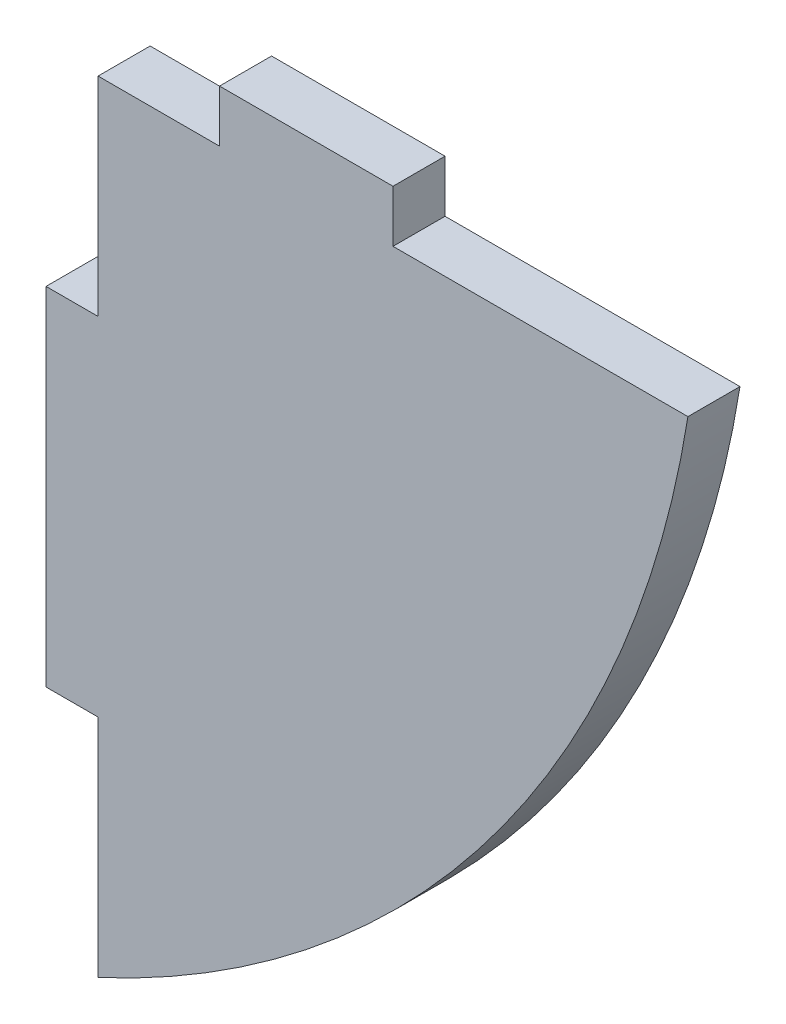
ISO-10303-21;
HEADER;
FILE_DESCRIPTION(('STEP AP214'),'2;1');
FILE_NAME('part.step','',(''),(''),'','','');
FILE_SCHEMA(('AUTOMOTIVE_DESIGN { 1 0 10303 214 1 1 1 1 }'));
ENDSEC;
DATA;
#1=APPLICATION_CONTEXT('core data for automotive mechanical design processes');
#2=APPLICATION_PROTOCOL_DEFINITION('international standard','automotive_design',2000,#1);
#3=PRODUCT_CONTEXT('',#1,'mechanical');
#4=PRODUCT('Part','Part','',(#3));
#5=PRODUCT_RELATED_PRODUCT_CATEGORY('part','',(#4));
#6=PRODUCT_DEFINITION_FORMATION('','',#4);
#7=PRODUCT_DEFINITION_CONTEXT('part definition',#1,'design');
#8=PRODUCT_DEFINITION('design','',#6,#7);
#9=PRODUCT_DEFINITION_SHAPE('','',#8);
#10=(LENGTH_UNIT() NAMED_UNIT(*) SI_UNIT(.MILLI.,.METRE.));
#11=(NAMED_UNIT(*) PLANE_ANGLE_UNIT() SI_UNIT($,.RADIAN.));
#12=(NAMED_UNIT(*) SI_UNIT($,.STERADIAN.) SOLID_ANGLE_UNIT());
#13=UNCERTAINTY_MEASURE_WITH_UNIT(LENGTH_MEASURE(1.E-05),#10,'distance_accuracy_value','');
#14=(GEOMETRIC_REPRESENTATION_CONTEXT(3) GLOBAL_UNCERTAINTY_ASSIGNED_CONTEXT((#13)) GLOBAL_UNIT_ASSIGNED_CONTEXT((#10,
#11,#12)) REPRESENTATION_CONTEXT('',''));
#15=CARTESIAN_POINT('',(0.,0.,0.));
#16=DIRECTION('',(0.,0.,1.));
#17=DIRECTION('',(1.,0.,0.));
#18=AXIS2_PLACEMENT_3D('',#15,#16,#17);
#19=CARTESIAN_POINT('',(0.,45.,1.5));
#20=DIRECTION('',(0.,-1.,0.));
#21=DIRECTION('',(0.,0.,-1.));
#22=AXIS2_PLACEMENT_3D('',#19,#20,#21);
#23=PLANE('',#22);
#24=DIRECTION('',(-1.,0.,0.));
#25=VECTOR('',#24,1.);
#26=CARTESIAN_POINT('',(0.,45.,-1.5));
#27=LINE('',#26,#25);
#28=CARTESIAN_POINT('',(7.,45.,-1.5));
#29=VERTEX_POINT('',#28);
#30=CARTESIAN_POINT('',(0.,45.,-1.5));
#31=VERTEX_POINT('',#30);
#32=EDGE_CURVE('E149',#29,#31,#27,.T.);
#33=ORIENTED_EDGE('',*,*,#32,.T.);
#34=DIRECTION('',(0.,0.,-1.));
#35=VECTOR('',#34,1.);
#36=CARTESIAN_POINT('',(0.,45.,1.5));
#37=LINE('',#36,#35);
#38=CARTESIAN_POINT('',(0.,45.,1.5));
#39=VERTEX_POINT('',#38);
#40=EDGE_CURVE('E11',#39,#31,#37,.T.);
#41=ORIENTED_EDGE('',*,*,#40,.F.);
#42=DIRECTION('',(-1.,0.,0.));
#43=VECTOR('',#42,1.);
#44=CARTESIAN_POINT('',(0.,45.,1.5));
#45=LINE('',#44,#43);
#46=CARTESIAN_POINT('',(7.,45.,1.5));
#47=VERTEX_POINT('',#46);
#48=EDGE_CURVE('E169',#47,#39,#45,.T.);
#49=ORIENTED_EDGE('',*,*,#48,.F.);
#50=DIRECTION('',(0.,0.,-1.));
#51=VECTOR('',#50,1.);
#52=CARTESIAN_POINT('',(7.,45.,1.5));
#53=LINE('',#52,#51);
#54=EDGE_CURVE('E145',#47,#29,#53,.T.);
#55=ORIENTED_EDGE('',*,*,#54,.T.);
#56=EDGE_LOOP('',(#33,#41,#49,#55));
#57=FACE_BOUND('',#56,.T.);
#58=ADVANCED_FACE('F35',(#57),#23,.F.);
#59=CARTESIAN_POINT('',(0.,45.,1.5));
#60=DIRECTION('',(1.,0.,0.));
#61=DIRECTION('',(0.,1.,0.));
#62=AXIS2_PLACEMENT_3D('',#59,#60,#61);
#63=PLANE('',#62);
#64=DIRECTION('',(0.,-1.,0.));
#65=VECTOR('',#64,1.);
#66=CARTESIAN_POINT('',(0.,45.,-1.5));
#67=LINE('',#66,#65);
#68=CARTESIAN_POINT('',(0.,33.,-1.5));
#69=VERTEX_POINT('',#68);
#70=EDGE_CURVE('E152',#31,#69,#67,.T.);
#71=ORIENTED_EDGE('',*,*,#70,.T.);
#72=DIRECTION('',(0.,0.,-1.));
#73=VECTOR('',#72,1.);
#74=CARTESIAN_POINT('',(0.,33.,1.5));
#75=LINE('',#74,#73);
#76=CARTESIAN_POINT('',(0.,33.,1.5));
#77=VERTEX_POINT('',#76);
#78=EDGE_CURVE('E43',#77,#69,#75,.T.);
#79=ORIENTED_EDGE('',*,*,#78,.F.);
#80=DIRECTION('',(0.,-1.,0.));
#81=VECTOR('',#80,1.);
#82=CARTESIAN_POINT('',(0.,45.,1.5));
#83=LINE('',#82,#81);
#84=EDGE_CURVE('E103',#39,#77,#83,.T.);
#85=ORIENTED_EDGE('',*,*,#84,.F.);
#86=ORIENTED_EDGE('',*,*,#40,.T.);
#87=EDGE_LOOP('',(#71,#79,#85,#86));
#88=FACE_BOUND('',#87,.T.);
#89=ADVANCED_FACE('F241',(#88),#63,.F.);
#90=CARTESIAN_POINT('',(0.,33.,1.5));
#91=DIRECTION('',(0.,-1.,0.));
#92=DIRECTION('',(1.,0.,0.));
#93=AXIS2_PLACEMENT_3D('',#90,#91,#92);
#94=PLANE('',#93);
#95=DIRECTION('',(-1.,0.,0.));
#96=VECTOR('',#95,1.);
#97=CARTESIAN_POINT('',(0.,33.,-1.5));
#98=LINE('',#97,#96);
#99=CARTESIAN_POINT('',(-3.,33.,-1.5));
#100=VERTEX_POINT('',#99);
#101=EDGE_CURVE('E154',#69,#100,#98,.T.);
#102=ORIENTED_EDGE('',*,*,#101,.T.);
#103=DIRECTION('',(0.,0.,-1.));
#104=VECTOR('',#103,1.);
#105=CARTESIAN_POINT('',(-3.,33.,1.5));
#106=LINE('',#105,#104);
#107=CARTESIAN_POINT('',(-3.,33.,1.5));
#108=VERTEX_POINT('',#107);
#109=EDGE_CURVE('E185',#108,#100,#106,.T.);
#110=ORIENTED_EDGE('',*,*,#109,.F.);
#111=DIRECTION('',(-1.,0.,0.));
#112=VECTOR('',#111,1.);
#113=CARTESIAN_POINT('',(0.,33.,1.5));
#114=LINE('',#113,#112);
#115=EDGE_CURVE('E193',#77,#108,#114,.T.);
#116=ORIENTED_EDGE('',*,*,#115,.F.);
#117=ORIENTED_EDGE('',*,*,#78,.T.);
#118=EDGE_LOOP('',(#102,#110,#116,#117));
#119=FACE_BOUND('',#118,.T.);
#120=ADVANCED_FACE('F191',(#119),#94,.F.);
#121=CARTESIAN_POINT('',(-3.,33.,1.5));
#122=DIRECTION('',(1.,0.,0.));
#123=DIRECTION('',(0.,1.,0.));
#124=AXIS2_PLACEMENT_3D('',#121,#122,#123);
#125=PLANE('',#124);
#126=DIRECTION('',(0.,-1.,0.));
#127=VECTOR('',#126,1.);
#128=CARTESIAN_POINT('',(-3.,33.,-1.5));
#129=LINE('',#128,#127);
#130=CARTESIAN_POINT('',(-3.,13.,-1.5));
#131=VERTEX_POINT('',#130);
#132=EDGE_CURVE('E156',#100,#131,#129,.T.);
#133=ORIENTED_EDGE('',*,*,#132,.T.);
#134=DIRECTION('',(0.,0.,-1.));
#135=VECTOR('',#134,1.);
#136=CARTESIAN_POINT('',(-3.,13.,1.5));
#137=LINE('',#136,#135);
#138=CARTESIAN_POINT('',(-3.,13.,1.5));
#139=VERTEX_POINT('',#138);
#140=EDGE_CURVE('E182',#139,#131,#137,.T.);
#141=ORIENTED_EDGE('',*,*,#140,.F.);
#142=DIRECTION('',(0.,-1.,0.));
#143=VECTOR('',#142,1.);
#144=CARTESIAN_POINT('',(-3.,33.,1.5));
#145=LINE('',#144,#143);
#146=EDGE_CURVE('E211',#108,#139,#145,.T.);
#147=ORIENTED_EDGE('',*,*,#146,.F.);
#148=ORIENTED_EDGE('',*,*,#109,.T.);
#149=EDGE_LOOP('',(#133,#141,#147,#148));
#150=FACE_BOUND('',#149,.T.);
#151=ADVANCED_FACE('F202',(#150),#125,.F.);
#152=CARTESIAN_POINT('',(-3.,13.,1.5));
#153=DIRECTION('',(0.,1.,0.));
#154=DIRECTION('',(0.,0.,1.));
#155=AXIS2_PLACEMENT_3D('',#152,#153,#154);
#156=PLANE('',#155);
#157=DIRECTION('',(1.,0.,0.));
#158=VECTOR('',#157,1.);
#159=CARTESIAN_POINT('',(-3.,13.,-1.5));
#160=LINE('',#159,#158);
#161=CARTESIAN_POINT('',(0.,13.,-1.5));
#162=VERTEX_POINT('',#161);
#163=EDGE_CURVE('E158',#131,#162,#160,.T.);
#164=ORIENTED_EDGE('',*,*,#163,.T.);
#165=DIRECTION('',(0.,0.,-1.));
#166=VECTOR('',#165,1.);
#167=CARTESIAN_POINT('',(0.,13.,1.5));
#168=LINE('',#167,#166);
#169=CARTESIAN_POINT('',(0.,13.,1.5));
#170=VERTEX_POINT('',#169);
#171=EDGE_CURVE('E179',#170,#162,#168,.T.);
#172=ORIENTED_EDGE('',*,*,#171,.F.);
#173=DIRECTION('',(1.,0.,0.));
#174=VECTOR('',#173,1.);
#175=CARTESIAN_POINT('',(-3.,13.,1.5));
#176=LINE('',#175,#174);
#177=EDGE_CURVE('E208',#139,#170,#176,.T.);
#178=ORIENTED_EDGE('',*,*,#177,.F.);
#179=ORIENTED_EDGE('',*,*,#140,.T.);
#180=EDGE_LOOP('',(#164,#172,#178,#179));
#181=FACE_BOUND('',#180,.T.);
#182=ADVANCED_FACE('F206',(#181),#156,.F.);
#183=CARTESIAN_POINT('',(0.,13.,1.5));
#184=DIRECTION('',(1.,0.,0.));
#185=DIRECTION('',(0.,1.,0.));
#186=AXIS2_PLACEMENT_3D('',#183,#184,#185);
#187=PLANE('',#186);
#188=DIRECTION('',(0.,-1.,0.));
#189=VECTOR('',#188,1.);
#190=CARTESIAN_POINT('',(0.,13.,-1.5));
#191=LINE('',#190,#189);
#192=CARTESIAN_POINT('',(0.,0.,-1.5));
#193=VERTEX_POINT('',#192);
#194=EDGE_CURVE('E160',#162,#193,#191,.T.);
#195=ORIENTED_EDGE('',*,*,#194,.T.);
#196=DIRECTION('',(0.,0.,-1.));
#197=VECTOR('',#196,1.);
#198=CARTESIAN_POINT('',(0.,0.,1.5));
#199=LINE('',#198,#197);
#200=CARTESIAN_POINT('',(0.,0.,1.5));
#201=VERTEX_POINT('',#200);
#202=EDGE_CURVE('E176',#201,#193,#199,.T.);
#203=ORIENTED_EDGE('',*,*,#202,.F.);
#204=DIRECTION('',(0.,-1.,0.));
#205=VECTOR('',#204,1.);
#206=CARTESIAN_POINT('',(0.,13.,1.5));
#207=LINE('',#206,#205);
#208=EDGE_CURVE('E210',#170,#201,#207,.T.);
#209=ORIENTED_EDGE('',*,*,#208,.F.);
#210=ORIENTED_EDGE('',*,*,#171,.T.);
#211=EDGE_LOOP('',(#195,#203,#209,#210));
#212=FACE_BOUND('',#211,.T.);
#213=ADVANCED_FACE('F254',(#212),#187,.F.);
#214=CARTESIAN_POINT('',(-25.2549660951019,54.4259743829659,1.5));
#215=DIRECTION('',(0.,0.,-1.));
#216=DIRECTION('',(-1.,0.,0.));
#217=AXIS2_PLACEMENT_3D('',#214,#215,#216);
#218=CYLINDRICAL_SURFACE('',#217,60.);
#219=CARTESIAN_POINT('',(-25.2549660951019,54.4259743829659,-1.5));
#220=DIRECTION('',(0.,0.,1.));
#221=DIRECTION('',(-1.,0.,0.));
#222=AXIS2_PLACEMENT_3D('',#219,#220,#221);
#223=CIRCLE('',#222,60.);
#224=CARTESIAN_POINT('',(34.,45.,-1.5));
#225=VERTEX_POINT('',#224);
#226=EDGE_CURVE('E162',#193,#225,#223,.T.);
#227=ORIENTED_EDGE('',*,*,#226,.T.);
#228=DIRECTION('',(0.,0.,-1.));
#229=VECTOR('',#228,1.);
#230=CARTESIAN_POINT('',(34.,45.,1.5));
#231=LINE('',#230,#229);
#232=CARTESIAN_POINT('',(34.,45.,1.5));
#233=VERTEX_POINT('',#232);
#234=EDGE_CURVE('E173',#233,#225,#231,.T.);
#235=ORIENTED_EDGE('',*,*,#234,.F.);
#236=CARTESIAN_POINT('',(-25.2549660951019,54.4259743829659,1.5));
#237=DIRECTION('',(0.,0.,1.));
#238=DIRECTION('',(-1.,0.,0.));
#239=AXIS2_PLACEMENT_3D('',#236,#237,#238);
#240=CIRCLE('',#239,60.);
#241=EDGE_CURVE('E213',#201,#233,#240,.T.);
#242=ORIENTED_EDGE('',*,*,#241,.F.);
#243=ORIENTED_EDGE('',*,*,#202,.T.);
#244=EDGE_LOOP('',(#227,#235,#242,#243));
#245=FACE_BOUND('',#244,.T.);
#246=ADVANCED_FACE('F222',(#245),#218,.T.);
#247=CARTESIAN_POINT('',(17.,45.,1.5));
#248=DIRECTION('',(0.,-1.,0.));
#249=DIRECTION('',(0.,0.,-1.));
#250=AXIS2_PLACEMENT_3D('',#247,#248,#249);
#251=PLANE('',#250);
#252=DIRECTION('',(-1.,0.,0.));
#253=VECTOR('',#252,1.);
#254=CARTESIAN_POINT('',(17.,45.,-1.5));
#255=LINE('',#254,#253);
#256=CARTESIAN_POINT('',(17.,45.,-1.5));
#257=VERTEX_POINT('',#256);
#258=EDGE_CURVE('E164',#225,#257,#255,.T.);
#259=ORIENTED_EDGE('',*,*,#258,.T.);
#260=DIRECTION('',(0.,0.,-1.));
#261=VECTOR('',#260,1.);
#262=CARTESIAN_POINT('',(17.,45.,1.5));
#263=LINE('',#262,#261);
#264=CARTESIAN_POINT('',(17.,45.,1.5));
#265=VERTEX_POINT('',#264);
#266=EDGE_CURVE('E140',#265,#257,#263,.T.);
#267=ORIENTED_EDGE('',*,*,#266,.F.);
#268=DIRECTION('',(-1.,0.,0.));
#269=VECTOR('',#268,1.);
#270=CARTESIAN_POINT('',(17.,45.,1.5));
#271=LINE('',#270,#269);
#272=EDGE_CURVE('E131',#233,#265,#271,.T.);
#273=ORIENTED_EDGE('',*,*,#272,.F.);
#274=ORIENTED_EDGE('',*,*,#234,.T.);
#275=EDGE_LOOP('',(#259,#267,#273,#274));
#276=FACE_BOUND('',#275,.T.);
#277=ADVANCED_FACE('F226',(#276),#251,.F.);
#278=CARTESIAN_POINT('',(17.,48.,1.5));
#279=DIRECTION('',(-1.,0.,0.));
#280=DIRECTION('',(0.,0.,1.));
#281=AXIS2_PLACEMENT_3D('',#278,#279,#280);
#282=PLANE('',#281);
#283=DIRECTION('',(0.,1.,0.));
#284=VECTOR('',#283,1.);
#285=CARTESIAN_POINT('',(17.,48.,-1.5));
#286=LINE('',#285,#284);
#287=CARTESIAN_POINT('',(17.,48.,-1.5));
#288=VERTEX_POINT('',#287);
#289=EDGE_CURVE('E139',#257,#288,#286,.T.);
#290=ORIENTED_EDGE('',*,*,#289,.T.);
#291=DIRECTION('',(0.,0.,-1.));
#292=VECTOR('',#291,1.);
#293=CARTESIAN_POINT('',(17.,48.,1.5));
#294=LINE('',#293,#292);
#295=CARTESIAN_POINT('',(17.,48.,1.5));
#296=VERTEX_POINT('',#295);
#297=EDGE_CURVE('E136',#296,#288,#294,.T.);
#298=ORIENTED_EDGE('',*,*,#297,.F.);
#299=DIRECTION('',(0.,1.,0.));
#300=VECTOR('',#299,1.);
#301=CARTESIAN_POINT('',(17.,48.,1.5));
#302=LINE('',#301,#300);
#303=EDGE_CURVE('E125',#265,#296,#302,.T.);
#304=ORIENTED_EDGE('',*,*,#303,.F.);
#305=ORIENTED_EDGE('',*,*,#266,.T.);
#306=EDGE_LOOP('',(#290,#298,#304,#305));
#307=FACE_BOUND('',#306,.T.);
#308=ADVANCED_FACE('F137',(#307),#282,.F.);
#309=CARTESIAN_POINT('',(7.,48.,1.5));
#310=DIRECTION('',(0.,-1.,0.));
#311=DIRECTION('',(0.,0.,-1.));
#312=AXIS2_PLACEMENT_3D('',#309,#310,#311);
#313=PLANE('',#312);
#314=DIRECTION('',(-1.,0.,0.));
#315=VECTOR('',#314,1.);
#316=CARTESIAN_POINT('',(7.,48.,-1.5));
#317=LINE('',#316,#315);
#318=CARTESIAN_POINT('',(7.,48.,-1.5));
#319=VERTEX_POINT('',#318);
#320=EDGE_CURVE('E89',#288,#319,#317,.T.);
#321=ORIENTED_EDGE('',*,*,#320,.T.);
#322=DIRECTION('',(0.,0.,-1.));
#323=VECTOR('',#322,1.);
#324=CARTESIAN_POINT('',(7.,48.,1.5));
#325=LINE('',#324,#323);
#326=CARTESIAN_POINT('',(7.,48.,1.5));
#327=VERTEX_POINT('',#326);
#328=EDGE_CURVE('E141',#327,#319,#325,.T.);
#329=ORIENTED_EDGE('',*,*,#328,.F.);
#330=DIRECTION('',(-1.,0.,0.));
#331=VECTOR('',#330,1.);
#332=CARTESIAN_POINT('',(7.,48.,1.5));
#333=LINE('',#332,#331);
#334=EDGE_CURVE('E129',#296,#327,#333,.T.);
#335=ORIENTED_EDGE('',*,*,#334,.F.);
#336=ORIENTED_EDGE('',*,*,#297,.T.);
#337=EDGE_LOOP('',(#321,#329,#335,#336));
#338=FACE_BOUND('',#337,.T.);
#339=ADVANCED_FACE('F143',(#338),#313,.F.);
#340=CARTESIAN_POINT('',(7.,45.,1.5));
#341=DIRECTION('',(1.,0.,0.));
#342=DIRECTION('',(0.,0.,-1.));
#343=AXIS2_PLACEMENT_3D('',#340,#341,#342);
#344=PLANE('',#343);
#345=DIRECTION('',(0.,-1.,0.));
#346=VECTOR('',#345,1.);
#347=CARTESIAN_POINT('',(7.,45.,-1.5));
#348=LINE('',#347,#346);
#349=EDGE_CURVE('E95',#319,#29,#348,.T.);
#350=ORIENTED_EDGE('',*,*,#349,.T.);
#351=ORIENTED_EDGE('',*,*,#54,.F.);
#352=DIRECTION('',(0.,-1.,0.));
#353=VECTOR('',#352,1.);
#354=CARTESIAN_POINT('',(7.,45.,1.5));
#355=LINE('',#354,#353);
#356=EDGE_CURVE('E51',#327,#47,#355,.T.);
#357=ORIENTED_EDGE('',*,*,#356,.F.);
#358=ORIENTED_EDGE('',*,*,#328,.T.);
#359=EDGE_LOOP('',(#350,#351,#357,#358));
#360=FACE_BOUND('',#359,.T.);
#361=ADVANCED_FACE('F230',(#360),#344,.F.);
#362=CARTESIAN_POINT('',(-25.2549660951019,54.4259743829659,1.5));
#363=DIRECTION('',(0.,0.,-1.));
#364=DIRECTION('',(-1.,0.,0.));
#365=AXIS2_PLACEMENT_3D('',#362,#363,#364);
#366=PLANE('',#365);
#367=ORIENTED_EDGE('',*,*,#48,.T.);
#368=ORIENTED_EDGE('',*,*,#84,.T.);
#369=ORIENTED_EDGE('',*,*,#115,.T.);
#370=ORIENTED_EDGE('',*,*,#146,.T.);
#371=ORIENTED_EDGE('',*,*,#177,.T.);
#372=ORIENTED_EDGE('',*,*,#208,.T.);
#373=ORIENTED_EDGE('',*,*,#241,.T.);
#374=ORIENTED_EDGE('',*,*,#272,.T.);
#375=ORIENTED_EDGE('',*,*,#303,.T.);
#376=ORIENTED_EDGE('',*,*,#334,.T.);
#377=ORIENTED_EDGE('',*,*,#356,.T.);
#378=EDGE_LOOP('',(#367,#368,#369,#370,#371,#372,#373,#374,#375,#376,#377));
#379=FACE_BOUND('',#378,.T.);
#380=ADVANCED_FACE('F127',(#379),#366,.F.);
#381=CARTESIAN_POINT('',(-25.2549660951019,54.4259743829659,-1.5));
#382=DIRECTION('',(0.,0.,-1.));
#383=DIRECTION('',(-1.,0.,0.));
#384=AXIS2_PLACEMENT_3D('',#381,#382,#383);
#385=PLANE('',#384);
#386=ORIENTED_EDGE('',*,*,#32,.F.);
#387=ORIENTED_EDGE('',*,*,#349,.F.);
#388=ORIENTED_EDGE('',*,*,#320,.F.);
#389=ORIENTED_EDGE('',*,*,#289,.F.);
#390=ORIENTED_EDGE('',*,*,#258,.F.);
#391=ORIENTED_EDGE('',*,*,#226,.F.);
#392=ORIENTED_EDGE('',*,*,#194,.F.);
#393=ORIENTED_EDGE('',*,*,#163,.F.);
#394=ORIENTED_EDGE('',*,*,#132,.F.);
#395=ORIENTED_EDGE('',*,*,#101,.F.);
#396=ORIENTED_EDGE('',*,*,#70,.F.);
#397=EDGE_LOOP('',(#386,#387,#388,#389,#390,#391,#392,#393,#394,#395,#396));
#398=FACE_BOUND('',#397,.T.);
#399=ADVANCED_FACE('F197',(#398),#385,.T.);
#400=CLOSED_SHELL('',(#58,#89,#120,#151,#182,#213,#246,#277,#308,#339,#361,#380,#399));
#401=MANIFOLD_SOLID_BREP('B2',#400);
#402=ADVANCED_BREP_SHAPE_REPRESENTATION('',(#18,#401),#14);
#403=SHAPE_DEFINITION_REPRESENTATION(#9,#402);
ENDSEC;
END-ISO-10303-21;
